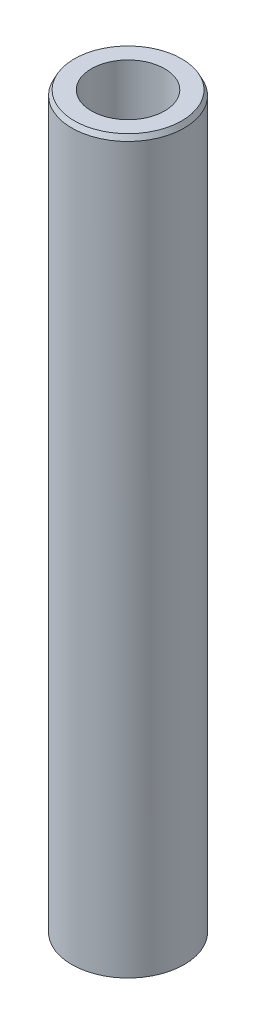
ISO-10303-21;
HEADER;
FILE_DESCRIPTION(('STEP AP214'),'2;1');
FILE_NAME('part.step','',(''),(''),'','','');
FILE_SCHEMA(('AUTOMOTIVE_DESIGN { 1 0 10303 214 1 1 1 1 }'));
ENDSEC;
DATA;
#1=APPLICATION_CONTEXT('core data for automotive mechanical design processes');
#2=APPLICATION_PROTOCOL_DEFINITION('international standard','automotive_design',2000,#1);
#3=PRODUCT_CONTEXT('',#1,'mechanical');
#4=PRODUCT('Part','Part','',(#3));
#5=PRODUCT_RELATED_PRODUCT_CATEGORY('part','',(#4));
#6=PRODUCT_DEFINITION_FORMATION('','',#4);
#7=PRODUCT_DEFINITION_CONTEXT('part definition',#1,'design');
#8=PRODUCT_DEFINITION('design','',#6,#7);
#9=PRODUCT_DEFINITION_SHAPE('','',#8);
#10=(LENGTH_UNIT() NAMED_UNIT(*) SI_UNIT(.MILLI.,.METRE.));
#11=(NAMED_UNIT(*) PLANE_ANGLE_UNIT() SI_UNIT($,.RADIAN.));
#12=(NAMED_UNIT(*) SI_UNIT($,.STERADIAN.) SOLID_ANGLE_UNIT());
#13=UNCERTAINTY_MEASURE_WITH_UNIT(LENGTH_MEASURE(1.E-05),#10,'distance_accuracy_value','');
#14=(GEOMETRIC_REPRESENTATION_CONTEXT(3) GLOBAL_UNCERTAINTY_ASSIGNED_CONTEXT((#13)) GLOBAL_UNIT_ASSIGNED_CONTEXT((#10,
#11,#12)) REPRESENTATION_CONTEXT('',''));
#15=CARTESIAN_POINT('',(0.,0.,0.));
#16=DIRECTION('',(0.,0.,1.));
#17=DIRECTION('',(1.,0.,0.));
#18=AXIS2_PLACEMENT_3D('',#15,#16,#17);
#19=CARTESIAN_POINT('',(0.,422.836836996908,0.));
#20=DIRECTION('',(0.,-1.,0.));
#21=DIRECTION('',(0.,0.,-1.));
#22=AXIS2_PLACEMENT_3D('',#19,#20,#21);
#23=CYLINDRICAL_SURFACE('',#22,32.5);
#24=CARTESIAN_POINT('',(0.,419.971842882658,0.));
#25=DIRECTION('',(0.,1.,0.));
#26=DIRECTION('',(0.,0.,1.));
#27=AXIS2_PLACEMENT_3D('',#24,#25,#26);
#28=CIRCLE('',#27,32.5);
#29=CARTESIAN_POINT('',(0.,419.971842882658,-32.5));
#30=VERTEX_POINT('',#29);
#31=EDGE_CURVE('E50',#30,#30,#28,.F.);
#32=ORIENTED_EDGE('',*,*,#31,.T.);
#33=EDGE_LOOP('',(#32));
#34=FACE_BOUND('',#33,.T.);
#35=CARTESIAN_POINT('',(0.,1.45991117282945,0.));
#36=DIRECTION('',(0.,1.,0.));
#37=DIRECTION('',(0.,0.,1.));
#38=AXIS2_PLACEMENT_3D('',#35,#36,#37);
#39=CIRCLE('',#38,32.5);
#40=CARTESIAN_POINT('',(0.,1.45991117282945,32.5));
#41=VERTEX_POINT('',#40);
#42=EDGE_CURVE('E51',#41,#41,#39,.T.);
#43=ORIENTED_EDGE('',*,*,#42,.T.);
#44=EDGE_LOOP('',(#43));
#45=FACE_BOUND('',#44,.T.);
#46=ADVANCED_FACE('F39',(#34,#45),#23,.T.);
#47=CARTESIAN_POINT('',(0.,422.836836996908,0.));
#48=DIRECTION('',(0.,1.,0.));
#49=DIRECTION('',(0.,0.,1.));
#50=AXIS2_PLACEMENT_3D('',#47,#48,#49);
#51=PLANE('',#50);
#52=CARTESIAN_POINT('',(0.,422.836836996908,0.));
#53=DIRECTION('',(0.,1.,0.));
#54=DIRECTION('',(0.,0.,1.));
#55=AXIS2_PLACEMENT_3D('',#52,#53,#54);
#56=CIRCLE('',#55,31.0400888271707);
#57=CARTESIAN_POINT('',(0.,422.836836996908,-31.0400888271707));
#58=VERTEX_POINT('',#57);
#59=EDGE_CURVE('E54',#58,#58,#56,.T.);
#60=ORIENTED_EDGE('',*,*,#59,.T.);
#61=EDGE_LOOP('',(#60));
#62=FACE_BOUND('',#61,.T.);
#63=CARTESIAN_POINT('',(0.,422.836836996908,0.));
#64=DIRECTION('',(0.,1.,0.));
#65=DIRECTION('',(0.,0.,1.));
#66=AXIS2_PLACEMENT_3D('',#63,#64,#65);
#67=CIRCLE('',#66,21.1535809543843);
#68=CARTESIAN_POINT('',(0.,422.836836996908,21.1535809543843));
#69=VERTEX_POINT('',#68);
#70=EDGE_CURVE('E58',#69,#69,#67,.T.);
#71=ORIENTED_EDGE('',*,*,#70,.F.);
#72=EDGE_LOOP('',(#71));
#73=FACE_BOUND('',#72,.T.);
#74=ADVANCED_FACE('F69',(#62,#73),#51,.T.);
#75=CARTESIAN_POINT('',(0.,0.,0.));
#76=DIRECTION('',(0.,1.,0.));
#77=DIRECTION('',(0.,0.,1.));
#78=AXIS2_PLACEMENT_3D('',#75,#76,#77);
#79=PLANE('',#78);
#80=CARTESIAN_POINT('',(0.,0.,0.));
#81=DIRECTION('',(0.,1.,0.));
#82=DIRECTION('',(0.,0.,1.));
#83=AXIS2_PLACEMENT_3D('',#80,#81,#82);
#84=CIRCLE('',#83,29.6350058857496);
#85=CARTESIAN_POINT('',(0.,0.,29.6350058857496));
#86=VERTEX_POINT('',#85);
#87=EDGE_CURVE('E10',#86,#86,#84,.F.);
#88=ORIENTED_EDGE('',*,*,#87,.T.);
#89=EDGE_LOOP('',(#88));
#90=FACE_BOUND('',#89,.T.);
#91=CARTESIAN_POINT('',(0.,0.,0.));
#92=DIRECTION('',(0.,1.,0.));
#93=DIRECTION('',(0.,0.,1.));
#94=AXIS2_PLACEMENT_3D('',#91,#92,#93);
#95=CIRCLE('',#94,21.1535809543843);
#96=CARTESIAN_POINT('',(0.,0.,21.1535809543843));
#97=VERTEX_POINT('',#96);
#98=EDGE_CURVE('E63',#97,#97,#95,.T.);
#99=ORIENTED_EDGE('',*,*,#98,.T.);
#100=EDGE_LOOP('',(#99));
#101=FACE_BOUND('',#100,.T.);
#102=ADVANCED_FACE('F75',(#90,#101),#79,.F.);
#103=CARTESIAN_POINT('',(0.,422.836836996908,0.));
#104=DIRECTION('',(0.,-1.,0.));
#105=DIRECTION('',(0.,0.,-1.));
#106=AXIS2_PLACEMENT_3D('',#103,#104,#105);
#107=CYLINDRICAL_SURFACE('',#106,21.1535809543843);
#108=ORIENTED_EDGE('',*,*,#70,.T.);
#109=EDGE_LOOP('',(#108));
#110=FACE_BOUND('',#109,.T.);
#111=ORIENTED_EDGE('',*,*,#98,.F.);
#112=EDGE_LOOP('',(#111));
#113=FACE_BOUND('',#112,.T.);
#114=ADVANCED_FACE('F70',(#110,#113),#107,.F.);
#115=CARTESIAN_POINT('',(0.,422.836836996908,0.));
#116=DIRECTION('',(0.,-1.,0.));
#117=DIRECTION('',(0.,0.,-1.));
#118=AXIS2_PLACEMENT_3D('',#115,#116,#117);
#119=CONICAL_SURFACE('',#118,31.0400888271707,0.471273191168115);
#120=CARTESIAN_POINT('',(0.,419.971842882658,-32.5));
#121=CARTESIAN_POINT('',(0.,420.001686571348,-32.4847925919497));
#122=CARTESIAN_POINT('',(0.,420.031530260038,-32.4695851838994));
#123=CARTESIAN_POINT('',(0.,420.091217637418,-32.4391703677988));
#124=CARTESIAN_POINT('',(0.,420.121061326108,-32.4239629597485));
#125=CARTESIAN_POINT('',(0.,420.180748703489,-32.3935481436479));
#126=CARTESIAN_POINT('',(0.,420.210592392179,-32.3783407355976));
#127=CARTESIAN_POINT('',(0.,420.270279769559,-32.347925919497));
#128=CARTESIAN_POINT('',(0.,420.300123458249,-32.3327185114466));
#129=CARTESIAN_POINT('',(0.,420.359810835629,-32.302303695346));
#130=CARTESIAN_POINT('',(0.,420.389654524319,-32.2870962872957));
#131=CARTESIAN_POINT('',(0.,420.4493419017,-32.2566814711951));
#132=CARTESIAN_POINT('',(0.,420.47918559039,-32.2414740631448));
#133=CARTESIAN_POINT('',(0.,420.53887296777,-32.2110592470442));
#134=CARTESIAN_POINT('',(0.,420.56871665646,-32.1958518389939));
#135=CARTESIAN_POINT('',(0.,420.62840403384,-32.1654370228933));
#136=CARTESIAN_POINT('',(0.,420.65824772253,-32.150229614843));
#137=CARTESIAN_POINT('',(0.,420.717935099911,-32.1198147987424));
#138=CARTESIAN_POINT('',(0.,420.747778788601,-32.1046073906921));
#139=CARTESIAN_POINT('',(0.,420.807466165981,-32.0741925745915));
#140=CARTESIAN_POINT('',(0.,420.837309854671,-32.0589851665412));
#141=CARTESIAN_POINT('',(0.,420.896997232051,-32.0285703504405));
#142=CARTESIAN_POINT('',(0.,420.926840920741,-32.0133629423902));
#143=CARTESIAN_POINT('',(0.,420.986528298121,-31.9829481262896));
#144=CARTESIAN_POINT('',(0.,421.016371986812,-31.9677407182393));
#145=CARTESIAN_POINT('',(0.,421.076059364192,-31.9373259021387));
#146=CARTESIAN_POINT('',(0.,421.105903052882,-31.9221184940884));
#147=CARTESIAN_POINT('',(0.,421.165590430262,-31.8917036779878));
#148=CARTESIAN_POINT('',(0.,421.195434118952,-31.8764962699375));
#149=CARTESIAN_POINT('',(0.,421.255121496332,-31.8460814538369));
#150=CARTESIAN_POINT('',(0.,421.284965185022,-31.8308740457866));
#151=CARTESIAN_POINT('',(0.,421.344652562403,-31.800459229686));
#152=CARTESIAN_POINT('',(0.,421.374496251093,-31.7852518216356));
#153=CARTESIAN_POINT('',(0.,421.434183628473,-31.754837005535));
#154=CARTESIAN_POINT('',(0.,421.464027317163,-31.7396295974847));
#155=CARTESIAN_POINT('',(0.,421.523714694543,-31.7092147813841));
#156=CARTESIAN_POINT('',(0.,421.553558383234,-31.6940073733338));
#157=CARTESIAN_POINT('',(0.,421.613245760614,-31.6635925572332));
#158=CARTESIAN_POINT('',(0.,421.643089449304,-31.6483851491829));
#159=CARTESIAN_POINT('',(0.,421.702776826684,-31.6179703330823));
#160=CARTESIAN_POINT('',(0.,421.732620515374,-31.602762925032));
#161=CARTESIAN_POINT('',(0.,421.792307892754,-31.5723481089314));
#162=CARTESIAN_POINT('',(0.,421.822151581444,-31.5571407008811));
#163=CARTESIAN_POINT('',(0.,421.881838958825,-31.5267258847805));
#164=CARTESIAN_POINT('',(0.,421.911682647515,-31.5115184767301));
#165=CARTESIAN_POINT('',(0.,421.971370024895,-31.4811036606295));
#166=CARTESIAN_POINT('',(0.,422.001213713585,-31.4658962525792));
#167=CARTESIAN_POINT('',(0.,422.060901090965,-31.4354814364786));
#168=CARTESIAN_POINT('',(0.,422.090744779655,-31.4202740284283));
#169=CARTESIAN_POINT('',(0.,422.150432157036,-31.3898592123277));
#170=CARTESIAN_POINT('',(0.,422.180275845726,-31.3746518042774));
#171=CARTESIAN_POINT('',(0.,422.239963223106,-31.3442369881768));
#172=CARTESIAN_POINT('',(0.,422.269806911796,-31.3290295801265));
#173=CARTESIAN_POINT('',(0.,422.329494289176,-31.2986147640259));
#174=CARTESIAN_POINT('',(0.,422.359337977866,-31.2834073559756));
#175=CARTESIAN_POINT('',(0.,422.419025355247,-31.2529925398749));
#176=CARTESIAN_POINT('',(0.,422.448869043937,-31.2377851318246));
#177=CARTESIAN_POINT('',(0.,422.508556421317,-31.207370315724));
#178=CARTESIAN_POINT('',(0.,422.538400110007,-31.1921629076737));
#179=CARTESIAN_POINT('',(0.,422.598087487387,-31.1617480915731));
#180=CARTESIAN_POINT('',(0.,422.627931176077,-31.1465406835228));
#181=CARTESIAN_POINT('',(0.,422.687618553458,-31.1161258674222));
#182=CARTESIAN_POINT('',(0.,422.717462242148,-31.1009184593719));
#183=CARTESIAN_POINT('',(0.,422.777149619528,-31.0705036432713));
#184=CARTESIAN_POINT('',(0.,422.806993308218,-31.055296235221));
#185=CARTESIAN_POINT('',(0.,422.836836996908,-31.0400888271707));
#186=B_SPLINE_CURVE_WITH_KNOTS('',3,(#120,#121,#122,#123,#124,#125,#126,#127,#128,#129,#130,
#131,#132,#133,#134,#135,#136,#137,#138,#139,#140,#141,#142,#143,#144,#145,#146,#147,#148,#149,
#150,#151,#152,#153,#154,#155,#156,#157,#158,#159,#160,#161,#162,#163,#164,#165,#166,#167,#168,
#169,#170,#171,#172,#173,#174,#175,#176,#177,#178,#179,#180,#181,#182,#183,#184,#185),
.UNSPECIFIED.,.F.,.F.,(4,2,2,2,2,2,2,2,2,2,2,2,2,2,2,2,2,2,2,2,2,2,2,2,2,2,2,2,2,2,2,2,4),(0.,
0.100484820386809,0.200969640773569,0.301454461160381,0.40193928154714,0.502424101933949,
0.602908922320709,0.703393742707521,0.803878563094281,0.90436338348109,1.00484820386785,
1.10533302425466,1.20581784464142,1.30630266502823,1.40678748541499,1.5072723058018,
1.60775712618856,1.70824194657537,1.80872676696213,1.90921158734894,2.0096964077357,
2.11018122812251,2.21066604850927,2.31115086889608,2.41163568928289,2.51212050966965,
2.61260533005646,2.71309015044322,2.81357497083003,2.91405979121679,3.0145446116036,
3.11502943199036,3.21551425237717),.UNSPECIFIED.);
#187=EDGE_CURVE('BSEAM81',#30,#58,#186,.T.);
#188=ORIENTED_EDGE('',*,*,#31,.F.);
#189=ORIENTED_EDGE('',*,*,#59,.F.);
#190=ORIENTED_EDGE('',*,*,#187,.T.);
#191=ORIENTED_EDGE('',*,*,#187,.F.);
#192=EDGE_LOOP('',(#188,#190,#189,#191));
#193=FACE_BOUND('',#192,.T.);
#194=ADVANCED_FACE('F81',(#193),#119,.T.);
#195=CARTESIAN_POINT('',(0.,1.45991117282945,0.));
#196=DIRECTION('',(0.,1.,0.));
#197=DIRECTION('',(0.,0.,1.));
#198=AXIS2_PLACEMENT_3D('',#195,#196,#197);
#199=CONICAL_SURFACE('',#198,32.5,1.09952313562678);
#200=ORIENTED_EDGE('',*,*,#87,.F.);
#201=EDGE_LOOP('',(#200));
#202=FACE_BOUND('',#201,.T.);
#203=ORIENTED_EDGE('',*,*,#42,.F.);
#204=EDGE_LOOP('',(#203));
#205=FACE_BOUND('',#204,.T.);
#206=ADVANCED_FACE('F45',(#202,#205),#199,.T.);
#207=CLOSED_SHELL('',(#46,#74,#102,#114,#194,#206));
#208=MANIFOLD_SOLID_BREP('B2',#207);
#209=ADVANCED_BREP_SHAPE_REPRESENTATION('',(#18,#208),#14);
#210=SHAPE_DEFINITION_REPRESENTATION(#9,#209);
ENDSEC;
END-ISO-10303-21;
